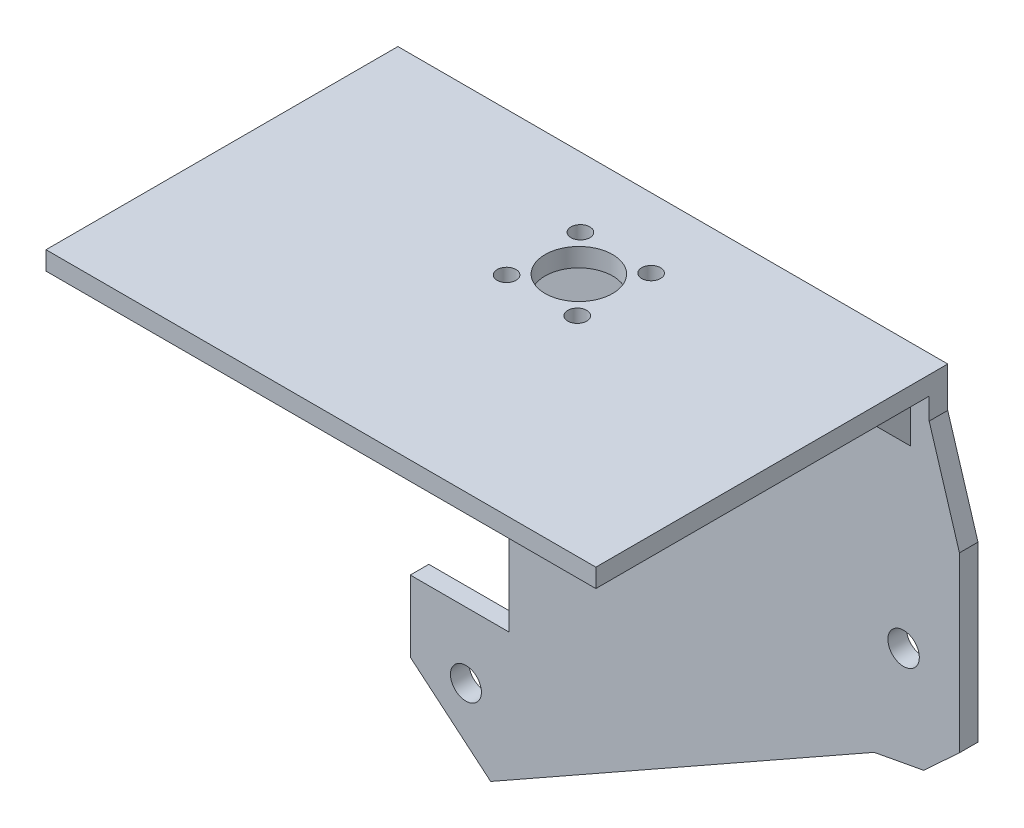
ISO-10303-21;
HEADER;
FILE_DESCRIPTION(('STEP AP214'),'2;1');
FILE_NAME('part.step','',(''),(''),'','','');
FILE_SCHEMA(('AUTOMOTIVE_DESIGN { 1 0 10303 214 1 1 1 1 }'));
ENDSEC;
DATA;
#1=APPLICATION_CONTEXT('core data for automotive mechanical design processes');
#2=APPLICATION_PROTOCOL_DEFINITION('international standard','automotive_design',2000,#1);
#3=PRODUCT_CONTEXT('',#1,'mechanical');
#4=PRODUCT('Part','Part','',(#3));
#5=PRODUCT_RELATED_PRODUCT_CATEGORY('part','',(#4));
#6=PRODUCT_DEFINITION_FORMATION('','',#4);
#7=PRODUCT_DEFINITION_CONTEXT('part definition',#1,'design');
#8=PRODUCT_DEFINITION('design','',#6,#7);
#9=PRODUCT_DEFINITION_SHAPE('','',#8);
#10=(LENGTH_UNIT() NAMED_UNIT(*) SI_UNIT(.MILLI.,.METRE.));
#11=(NAMED_UNIT(*) PLANE_ANGLE_UNIT() SI_UNIT($,.RADIAN.));
#12=(NAMED_UNIT(*) SI_UNIT($,.STERADIAN.) SOLID_ANGLE_UNIT());
#13=UNCERTAINTY_MEASURE_WITH_UNIT(LENGTH_MEASURE(1.E-05),#10,'distance_accuracy_value','');
#14=(GEOMETRIC_REPRESENTATION_CONTEXT(3) GLOBAL_UNCERTAINTY_ASSIGNED_CONTEXT((#13)) GLOBAL_UNIT_ASSIGNED_CONTEXT((#10,
#11,#12)) REPRESENTATION_CONTEXT('',''));
#15=CARTESIAN_POINT('',(0.,0.,0.));
#16=DIRECTION('',(0.,0.,1.));
#17=DIRECTION('',(1.,0.,0.));
#18=AXIS2_PLACEMENT_3D('',#15,#16,#17);
#19=CARTESIAN_POINT('',(1.39999999999998,-11.5,0.));
#20=DIRECTION('',(0.,-0.707106781186548,0.707106781186547));
#21=DIRECTION('',(0.,-0.707106781186547,-0.707106781186548));
#22=AXIS2_PLACEMENT_3D('',#19,#20,#21);
#23=PLANE('',#22);
#24=DIRECTION('',(1.,0.,0.));
#25=VECTOR('',#24,1.);
#26=CARTESIAN_POINT('',(0.,-8.5,3.));
#27=LINE('',#26,#25);
#28=CARTESIAN_POINT('',(1.39999999999998,-8.5,3.));
#29=VERTEX_POINT('',#28);
#30=CARTESIAN_POINT('',(4.572,-8.5,3.));
#31=VERTEX_POINT('',#30);
#32=EDGE_CURVE('E48',#29,#31,#27,.T.);
#33=ORIENTED_EDGE('',*,*,#32,.T.);
#34=DIRECTION('',(0.,0.707106781186547,0.707106781186548));
#35=VECTOR('',#34,1.);
#36=CARTESIAN_POINT('',(4.572,-11.5,0.));
#37=LINE('',#36,#35);
#38=CARTESIAN_POINT('',(4.572,0.,11.5));
#39=VERTEX_POINT('',#38);
#40=EDGE_CURVE('E11',#31,#39,#37,.T.);
#41=ORIENTED_EDGE('',*,*,#40,.T.);
#42=DIRECTION('',(1.,0.,0.));
#43=VECTOR('',#42,1.);
#44=CARTESIAN_POINT('',(1.39999999999998,0.,11.5));
#45=LINE('',#44,#43);
#46=CARTESIAN_POINT('',(1.39999999999998,0.,11.5));
#47=VERTEX_POINT('',#46);
#48=EDGE_CURVE('E199',#47,#39,#45,.T.);
#49=ORIENTED_EDGE('',*,*,#48,.F.);
#50=DIRECTION('',(0.,-0.707106781186547,-0.707106781186548));
#51=VECTOR('',#50,1.);
#52=CARTESIAN_POINT('',(1.39999999999998,-11.5,0.));
#53=LINE('',#52,#51);
#54=EDGE_CURVE('E194',#47,#29,#53,.T.);
#55=ORIENTED_EDGE('',*,*,#54,.T.);
#56=EDGE_LOOP('',(#33,#41,#49,#55));
#57=FACE_BOUND('',#56,.T.);
#58=ADVANCED_FACE('F33',(#57),#23,.T.);
#59=CARTESIAN_POINT('',(79.502,0.,11.5));
#60=VERTEX_POINT('',#59);
#61=CARTESIAN_POINT('',(85.9,0.,11.5));
#62=VERTEX_POINT('',#61);
#63=EDGE_CURVE('E355',#60,#62,#45,.T.);
#64=ORIENTED_EDGE('',*,*,#63,.F.);
#65=DIRECTION('',(0.,-0.707106781186547,-0.707106781186548));
#66=VECTOR('',#65,1.);
#67=CARTESIAN_POINT('',(79.502,-11.5,0.));
#68=LINE('',#67,#66);
#69=CARTESIAN_POINT('',(79.502,-8.5,3.));
#70=VERTEX_POINT('',#69);
#71=EDGE_CURVE('E41',#60,#70,#68,.T.);
#72=ORIENTED_EDGE('',*,*,#71,.T.);
#73=CARTESIAN_POINT('',(85.9,-8.5,3.));
#74=VERTEX_POINT('',#73);
#75=EDGE_CURVE('E56',#70,#74,#27,.T.);
#76=ORIENTED_EDGE('',*,*,#75,.T.);
#77=DIRECTION('',(0.,-0.707106781186547,-0.707106781186548));
#78=VECTOR('',#77,1.);
#79=CARTESIAN_POINT('',(85.9,-11.5,0.));
#80=LINE('',#79,#78);
#81=EDGE_CURVE('E352',#62,#74,#80,.T.);
#82=ORIENTED_EDGE('',*,*,#81,.F.);
#83=EDGE_LOOP('',(#64,#72,#76,#82));
#84=FACE_BOUND('',#83,.T.);
#85=ADVANCED_FACE('F354',(#84),#23,.T.);
#86=CARTESIAN_POINT('',(0.,0.,3.));
#87=DIRECTION('',(1.,0.,0.));
#88=DIRECTION('',(0.,1.,0.));
#89=AXIS2_PLACEMENT_3D('',#86,#87,#88);
#90=PLANE('',#89);
#91=DIRECTION('',(0.,-1.,0.));
#92=VECTOR('',#91,1.);
#93=CARTESIAN_POINT('',(0.,0.,0.));
#94=LINE('',#93,#92);
#95=CARTESIAN_POINT('',(0.,3.,0.));
#96=VERTEX_POINT('',#95);
#97=CARTESIAN_POINT('',(0.,-16.2,0.));
#98=VERTEX_POINT('',#97);
#99=EDGE_CURVE('E258',#96,#98,#94,.T.);
#100=ORIENTED_EDGE('',*,*,#99,.T.);
#101=DIRECTION('',(0.,0.,-1.));
#102=VECTOR('',#101,1.);
#103=CARTESIAN_POINT('',(0.,-16.2,3.));
#104=LINE('',#103,#102);
#105=CARTESIAN_POINT('',(0.,-16.2,3.));
#106=VERTEX_POINT('',#105);
#107=EDGE_CURVE('E343',#106,#98,#104,.T.);
#108=ORIENTED_EDGE('',*,*,#107,.F.);
#109=DIRECTION('',(0.,-1.,0.));
#110=VECTOR('',#109,1.);
#111=CARTESIAN_POINT('',(0.,0.,3.));
#112=LINE('',#111,#110);
#113=CARTESIAN_POINT('',(0.,0.,3.));
#114=VERTEX_POINT('',#113);
#115=EDGE_CURVE('E259',#114,#106,#112,.T.);
#116=ORIENTED_EDGE('',*,*,#115,.F.);
#117=DIRECTION('',(0.,0.,1.));
#118=VECTOR('',#117,1.);
#119=CARTESIAN_POINT('',(0.,0.,0.));
#120=LINE('',#119,#118);
#121=CARTESIAN_POINT('',(0.,0.,56.896));
#122=VERTEX_POINT('',#121);
#123=EDGE_CURVE('E232',#114,#122,#120,.T.);
#124=ORIENTED_EDGE('',*,*,#123,.T.);
#125=DIRECTION('',(0.,-1.,0.));
#126=VECTOR('',#125,1.);
#127=CARTESIAN_POINT('',(0.,3.,56.896));
#128=LINE('',#127,#126);
#129=CARTESIAN_POINT('',(0.,3.,56.896));
#130=VERTEX_POINT('',#129);
#131=EDGE_CURVE('E255',#130,#122,#128,.T.);
#132=ORIENTED_EDGE('',*,*,#131,.F.);
#133=DIRECTION('',(0.,0.,1.));
#134=VECTOR('',#133,1.);
#135=CARTESIAN_POINT('',(0.,3.,0.));
#136=LINE('',#135,#134);
#137=EDGE_CURVE('E235',#96,#130,#136,.T.);
#138=ORIENTED_EDGE('',*,*,#137,.F.);
#139=EDGE_LOOP('',(#100,#108,#116,#124,#132,#138));
#140=FACE_BOUND('',#139,.T.);
#141=ADVANCED_FACE('F35',(#140),#90,.F.);
#142=CARTESIAN_POINT('',(0.,-16.2,3.));
#143=DIRECTION('',(0.,1.,0.));
#144=DIRECTION('',(0.,0.,1.));
#145=AXIS2_PLACEMENT_3D('',#142,#143,#144);
#146=PLANE('',#145);
#147=DIRECTION('',(1.,0.,0.));
#148=VECTOR('',#147,1.);
#149=CARTESIAN_POINT('',(0.,-16.2,0.));
#150=LINE('',#149,#148);
#151=CARTESIAN_POINT('',(21.,-16.2,0.));
#152=VERTEX_POINT('',#151);
#153=EDGE_CURVE('E293',#98,#152,#150,.T.);
#154=ORIENTED_EDGE('',*,*,#153,.T.);
#155=DIRECTION('',(0.,0.,-1.));
#156=VECTOR('',#155,1.);
#157=CARTESIAN_POINT('',(21.,-16.2,3.));
#158=LINE('',#157,#156);
#159=CARTESIAN_POINT('',(21.,-16.2,3.));
#160=VERTEX_POINT('',#159);
#161=EDGE_CURVE('E340',#160,#152,#158,.T.);
#162=ORIENTED_EDGE('',*,*,#161,.F.);
#163=DIRECTION('',(1.,0.,0.));
#164=VECTOR('',#163,1.);
#165=CARTESIAN_POINT('',(0.,-16.2,3.));
#166=LINE('',#165,#164);
#167=EDGE_CURVE('E262',#106,#160,#166,.T.);
#168=ORIENTED_EDGE('',*,*,#167,.F.);
#169=ORIENTED_EDGE('',*,*,#107,.T.);
#170=EDGE_LOOP('',(#154,#162,#168,#169));
#171=FACE_BOUND('',#170,.T.);
#172=ADVANCED_FACE('F481',(#171),#146,.F.);
#173=CARTESIAN_POINT('',(21.,-16.2,3.));
#174=DIRECTION('',(1.,0.,0.));
#175=DIRECTION('',(0.,1.,0.));
#176=AXIS2_PLACEMENT_3D('',#173,#174,#175);
#177=PLANE('',#176);
#178=DIRECTION('',(0.,-1.,0.));
#179=VECTOR('',#178,1.);
#180=CARTESIAN_POINT('',(21.,-16.2,0.));
#181=LINE('',#180,#179);
#182=CARTESIAN_POINT('',(21.,-67.,0.));
#183=VERTEX_POINT('',#182);
#184=EDGE_CURVE('E295',#152,#183,#181,.T.);
#185=ORIENTED_EDGE('',*,*,#184,.T.);
#186=DIRECTION('',(0.,0.,-1.));
#187=VECTOR('',#186,1.);
#188=CARTESIAN_POINT('',(21.,-67.,3.));
#189=LINE('',#188,#187);
#190=CARTESIAN_POINT('',(21.,-67.,3.));
#191=VERTEX_POINT('',#190);
#192=EDGE_CURVE('E337',#191,#183,#189,.T.);
#193=ORIENTED_EDGE('',*,*,#192,.F.);
#194=DIRECTION('',(0.,-1.,0.));
#195=VECTOR('',#194,1.);
#196=CARTESIAN_POINT('',(21.,-16.2,3.));
#197=LINE('',#196,#195);
#198=EDGE_CURVE('E265',#160,#191,#197,.T.);
#199=ORIENTED_EDGE('',*,*,#198,.F.);
#200=ORIENTED_EDGE('',*,*,#161,.T.);
#201=EDGE_LOOP('',(#185,#193,#199,#200));
#202=FACE_BOUND('',#201,.T.);
#203=ADVANCED_FACE('F478',(#202),#177,.F.);
#204=CARTESIAN_POINT('',(21.,-67.,3.));
#205=DIRECTION('',(0.,-1.,0.));
#206=DIRECTION('',(0.,0.,-1.));
#207=AXIS2_PLACEMENT_3D('',#204,#205,#206);
#208=PLANE('',#207);
#209=DIRECTION('',(-1.,0.,0.));
#210=VECTOR('',#209,1.);
#211=CARTESIAN_POINT('',(21.,-67.,0.));
#212=LINE('',#211,#210);
#213=CARTESIAN_POINT('',(5.00000000000001,-67.,0.));
#214=VERTEX_POINT('',#213);
#215=EDGE_CURVE('E297',#183,#214,#212,.T.);
#216=ORIENTED_EDGE('',*,*,#215,.T.);
#217=DIRECTION('',(0.,0.,-1.));
#218=VECTOR('',#217,1.);
#219=CARTESIAN_POINT('',(5.00000000000001,-67.,3.));
#220=LINE('',#219,#218);
#221=CARTESIAN_POINT('',(5.00000000000001,-67.,3.));
#222=VERTEX_POINT('',#221);
#223=EDGE_CURVE('E334',#222,#214,#220,.T.);
#224=ORIENTED_EDGE('',*,*,#223,.F.);
#225=DIRECTION('',(-1.,0.,0.));
#226=VECTOR('',#225,1.);
#227=CARTESIAN_POINT('',(21.,-67.,3.));
#228=LINE('',#227,#226);
#229=EDGE_CURVE('E267',#191,#222,#228,.T.);
#230=ORIENTED_EDGE('',*,*,#229,.F.);
#231=ORIENTED_EDGE('',*,*,#192,.T.);
#232=EDGE_LOOP('',(#216,#224,#230,#231));
#233=FACE_BOUND('',#232,.T.);
#234=ADVANCED_FACE('F474',(#233),#208,.F.);
#235=CARTESIAN_POINT('',(5.00000000000001,-67.,3.));
#236=DIRECTION('',(1.,0.,0.));
#237=DIRECTION('',(0.,1.,0.));
#238=AXIS2_PLACEMENT_3D('',#235,#236,#237);
#239=PLANE('',#238);
#240=DIRECTION('',(0.,-1.,0.));
#241=VECTOR('',#240,1.);
#242=CARTESIAN_POINT('',(5.00000000000001,-67.,0.));
#243=LINE('',#242,#241);
#244=CARTESIAN_POINT('',(5.00000000000001,-78.5,0.));
#245=VERTEX_POINT('',#244);
#246=EDGE_CURVE('E299',#214,#245,#243,.T.);
#247=ORIENTED_EDGE('',*,*,#246,.T.);
#248=DIRECTION('',(0.,0.,-1.));
#249=VECTOR('',#248,1.);
#250=CARTESIAN_POINT('',(5.00000000000001,-78.5,3.));
#251=LINE('',#250,#249);
#252=CARTESIAN_POINT('',(5.00000000000001,-78.5,3.));
#253=VERTEX_POINT('',#252);
#254=EDGE_CURVE('E331',#253,#245,#251,.T.);
#255=ORIENTED_EDGE('',*,*,#254,.F.);
#256=DIRECTION('',(0.,-1.,0.));
#257=VECTOR('',#256,1.);
#258=CARTESIAN_POINT('',(5.00000000000001,-67.,3.));
#259=LINE('',#258,#257);
#260=EDGE_CURVE('E269',#222,#253,#259,.T.);
#261=ORIENTED_EDGE('',*,*,#260,.F.);
#262=ORIENTED_EDGE('',*,*,#223,.T.);
#263=EDGE_LOOP('',(#247,#255,#261,#262));
#264=FACE_BOUND('',#263,.T.);
#265=ADVANCED_FACE('F470',(#264),#239,.F.);
#266=CARTESIAN_POINT('',(5.00000000000001,-78.5,3.));
#267=DIRECTION('',(0.642787609686537,0.76604444311898,0.));
#268=DIRECTION('',(-0.76604444311898,0.642787609686537,0.));
#269=AXIS2_PLACEMENT_3D('',#266,#267,#268);
#270=PLANE('',#269);
#271=DIRECTION('',(0.76604444311898,-0.642787609686537,0.));
#272=VECTOR('',#271,1.);
#273=CARTESIAN_POINT('',(5.00000000000001,-78.5,0.));
#274=LINE('',#273,#272);
#275=CARTESIAN_POINT('',(18.,-89.4082952053046,0.));
#276=VERTEX_POINT('',#275);
#277=EDGE_CURVE('E301',#245,#276,#274,.T.);
#278=ORIENTED_EDGE('',*,*,#277,.T.);
#279=DIRECTION('',(0.,0.,-1.));
#280=VECTOR('',#279,1.);
#281=CARTESIAN_POINT('',(18.,-89.4082952053046,3.));
#282=LINE('',#281,#280);
#283=CARTESIAN_POINT('',(18.,-89.4082952053046,3.));
#284=VERTEX_POINT('',#283);
#285=EDGE_CURVE('E328',#284,#276,#282,.T.);
#286=ORIENTED_EDGE('',*,*,#285,.F.);
#287=DIRECTION('',(0.76604444311898,-0.642787609686537,0.));
#288=VECTOR('',#287,1.);
#289=CARTESIAN_POINT('',(5.00000000000001,-78.5,3.));
#290=LINE('',#289,#288);
#291=EDGE_CURVE('E271',#253,#284,#290,.T.);
#292=ORIENTED_EDGE('',*,*,#291,.F.);
#293=ORIENTED_EDGE('',*,*,#254,.T.);
#294=EDGE_LOOP('',(#278,#286,#292,#293));
#295=FACE_BOUND('',#294,.T.);
#296=ADVANCED_FACE('F466',(#295),#270,.F.);
#297=CARTESIAN_POINT('',(18.,-89.4082952053046,3.));
#298=DIRECTION('',(-0.492423560103472,0.870355695939897,0.));
#299=DIRECTION('',(-0.870355695939897,-0.492423560103472,0.));
#300=AXIS2_PLACEMENT_3D('',#297,#298,#299);
#301=PLANE('',#300);
#302=DIRECTION('',(0.870355695939897,0.492423560103472,0.));
#303=VECTOR('',#302,1.);
#304=CARTESIAN_POINT('',(18.,-89.4082952053046,0.));
#305=LINE('',#304,#303);
#306=CARTESIAN_POINT('',(80.,-54.3303829576624,0.));
#307=VERTEX_POINT('',#306);
#308=EDGE_CURVE('E303',#276,#307,#305,.T.);
#309=ORIENTED_EDGE('',*,*,#308,.T.);
#310=DIRECTION('',(0.,0.,-1.));
#311=VECTOR('',#310,1.);
#312=CARTESIAN_POINT('',(80.,-54.3303829576624,3.));
#313=LINE('',#312,#311);
#314=CARTESIAN_POINT('',(80.,-54.3303829576624,3.));
#315=VERTEX_POINT('',#314);
#316=EDGE_CURVE('E325',#315,#307,#313,.T.);
#317=ORIENTED_EDGE('',*,*,#316,.F.);
#318=DIRECTION('',(0.870355695939897,0.492423560103472,0.));
#319=VECTOR('',#318,1.);
#320=CARTESIAN_POINT('',(18.,-89.4082952053046,3.));
#321=LINE('',#320,#319);
#322=EDGE_CURVE('E273',#284,#315,#321,.T.);
#323=ORIENTED_EDGE('',*,*,#322,.F.);
#324=ORIENTED_EDGE('',*,*,#285,.T.);
#325=EDGE_LOOP('',(#309,#317,#323,#324));
#326=FACE_BOUND('',#325,.T.);
#327=ADVANCED_FACE('F462',(#326),#301,.F.);
#328=CARTESIAN_POINT('',(80.,-54.3303829576624,3.));
#329=DIRECTION('',(-0.182235525492152,0.983254907563954,0.));
#330=DIRECTION('',(-0.983254907563954,-0.182235525492152,0.));
#331=AXIS2_PLACEMENT_3D('',#328,#329,#330);
#332=PLANE('',#331);
#333=DIRECTION('',(0.983254907563954,0.182235525492152,0.));
#334=VECTOR('',#333,1.);
#335=CARTESIAN_POINT('',(80.,-54.3303829576624,0.));
#336=LINE('',#335,#334);
#337=CARTESIAN_POINT('',(88.,-52.84767059821,0.));
#338=VERTEX_POINT('',#337);
#339=EDGE_CURVE('E305',#307,#338,#336,.T.);
#340=ORIENTED_EDGE('',*,*,#339,.T.);
#341=DIRECTION('',(0.,0.,-1.));
#342=VECTOR('',#341,1.);
#343=CARTESIAN_POINT('',(88.,-52.84767059821,3.));
#344=LINE('',#343,#342);
#345=CARTESIAN_POINT('',(88.,-52.84767059821,3.));
#346=VERTEX_POINT('',#345);
#347=EDGE_CURVE('E322',#346,#338,#344,.T.);
#348=ORIENTED_EDGE('',*,*,#347,.F.);
#349=DIRECTION('',(0.983254907563954,0.182235525492152,0.));
#350=VECTOR('',#349,1.);
#351=CARTESIAN_POINT('',(80.,-54.3303829576624,3.));
#352=LINE('',#351,#350);
#353=EDGE_CURVE('E275',#315,#346,#352,.T.);
#354=ORIENTED_EDGE('',*,*,#353,.F.);
#355=ORIENTED_EDGE('',*,*,#316,.T.);
#356=EDGE_LOOP('',(#340,#348,#354,#355));
#357=FACE_BOUND('',#356,.T.);
#358=ADVANCED_FACE('F458',(#357),#332,.F.);
#359=CARTESIAN_POINT('',(88.,-52.84767059821,3.));
#360=DIRECTION('',(-0.678382452150343,0.734708955038992,0.));
#361=DIRECTION('',(-0.734708955038992,-0.678382452150343,0.));
#362=AXIS2_PLACEMENT_3D('',#359,#360,#361);
#363=PLANE('',#362);
#364=DIRECTION('',(0.734708955038992,0.678382452150343,0.));
#365=VECTOR('',#364,1.);
#366=CARTESIAN_POINT('',(88.,-52.84767059821,0.));
#367=LINE('',#366,#365);
#368=CARTESIAN_POINT('',(93.7916909033386,-47.5,0.));
#369=VERTEX_POINT('',#368);
#370=EDGE_CURVE('E307',#338,#369,#367,.T.);
#371=ORIENTED_EDGE('',*,*,#370,.T.);
#372=DIRECTION('',(0.,0.,-1.));
#373=VECTOR('',#372,1.);
#374=CARTESIAN_POINT('',(93.7916909033386,-47.5,3.));
#375=LINE('',#374,#373);
#376=CARTESIAN_POINT('',(93.7916909033386,-47.5,3.));
#377=VERTEX_POINT('',#376);
#378=EDGE_CURVE('E319',#377,#369,#375,.T.);
#379=ORIENTED_EDGE('',*,*,#378,.F.);
#380=DIRECTION('',(0.734708955038992,0.678382452150343,0.));
#381=VECTOR('',#380,1.);
#382=CARTESIAN_POINT('',(88.,-52.84767059821,3.));
#383=LINE('',#382,#381);
#384=EDGE_CURVE('E277',#346,#377,#383,.T.);
#385=ORIENTED_EDGE('',*,*,#384,.F.);
#386=ORIENTED_EDGE('',*,*,#347,.T.);
#387=EDGE_LOOP('',(#371,#379,#385,#386));
#388=FACE_BOUND('',#387,.T.);
#389=ADVANCED_FACE('F454',(#388),#363,.F.);
#390=CARTESIAN_POINT('',(93.7916909033386,-19.5,3.));
#391=DIRECTION('',(-1.,0.,0.));
#392=DIRECTION('',(0.,-1.,0.));
#393=AXIS2_PLACEMENT_3D('',#390,#391,#392);
#394=PLANE('',#393);
#395=DIRECTION('',(0.,1.,0.));
#396=VECTOR('',#395,1.);
#397=CARTESIAN_POINT('',(93.7916909033386,-19.5,0.));
#398=LINE('',#397,#396);
#399=CARTESIAN_POINT('',(93.7916909033386,-19.5,0.));
#400=VERTEX_POINT('',#399);
#401=EDGE_CURVE('E309',#369,#400,#398,.T.);
#402=ORIENTED_EDGE('',*,*,#401,.T.);
#403=DIRECTION('',(0.,0.,-1.));
#404=VECTOR('',#403,1.);
#405=CARTESIAN_POINT('',(93.7916909033386,-19.5,3.));
#406=LINE('',#405,#404);
#407=CARTESIAN_POINT('',(93.7916909033386,-19.5,3.));
#408=VERTEX_POINT('',#407);
#409=EDGE_CURVE('E316',#408,#400,#406,.T.);
#410=ORIENTED_EDGE('',*,*,#409,.F.);
#411=DIRECTION('',(0.,1.,0.));
#412=VECTOR('',#411,1.);
#413=CARTESIAN_POINT('',(93.7916909033386,-19.5,3.));
#414=LINE('',#413,#412);
#415=EDGE_CURVE('E279',#377,#408,#414,.T.);
#416=ORIENTED_EDGE('',*,*,#415,.F.);
#417=ORIENTED_EDGE('',*,*,#378,.T.);
#418=EDGE_LOOP('',(#402,#410,#416,#417));
#419=FACE_BOUND('',#418,.T.);
#420=ADVANCED_FACE('F450',(#419),#394,.F.);
#421=CARTESIAN_POINT('',(88.9,-3.5,3.));
#422=DIRECTION('',(-0.956304755963035,-0.292371704722738,0.));
#423=DIRECTION('',(0.292371704722738,-0.956304755963035,0.));
#424=AXIS2_PLACEMENT_3D('',#421,#422,#423);
#425=PLANE('',#424);
#426=DIRECTION('',(-0.292371704722738,0.956304755963035,0.));
#427=VECTOR('',#426,1.);
#428=CARTESIAN_POINT('',(88.9,-3.5,0.));
#429=LINE('',#428,#427);
#430=CARTESIAN_POINT('',(88.9,-3.5,0.));
#431=VERTEX_POINT('',#430);
#432=EDGE_CURVE('E311',#400,#431,#429,.T.);
#433=ORIENTED_EDGE('',*,*,#432,.T.);
#434=DIRECTION('',(0.,0.,-1.));
#435=VECTOR('',#434,1.);
#436=CARTESIAN_POINT('',(88.9,-3.5,3.));
#437=LINE('',#436,#435);
#438=CARTESIAN_POINT('',(88.9,-3.5,3.));
#439=VERTEX_POINT('',#438);
#440=EDGE_CURVE('E290',#439,#431,#437,.T.);
#441=ORIENTED_EDGE('',*,*,#440,.F.);
#442=DIRECTION('',(-0.292371704722738,0.956304755963035,0.));
#443=VECTOR('',#442,1.);
#444=CARTESIAN_POINT('',(88.9,-3.5,3.));
#445=LINE('',#444,#443);
#446=EDGE_CURVE('E281',#408,#439,#445,.T.);
#447=ORIENTED_EDGE('',*,*,#446,.F.);
#448=ORIENTED_EDGE('',*,*,#409,.T.);
#449=EDGE_LOOP('',(#433,#441,#447,#448));
#450=FACE_BOUND('',#449,.T.);
#451=ADVANCED_FACE('F446',(#450),#425,.F.);
#452=CARTESIAN_POINT('',(88.9,0.,3.));
#453=DIRECTION('',(-1.,0.,0.));
#454=DIRECTION('',(0.,0.,1.));
#455=AXIS2_PLACEMENT_3D('',#452,#453,#454);
#456=PLANE('',#455);
#457=DIRECTION('',(0.,1.,0.));
#458=VECTOR('',#457,1.);
#459=CARTESIAN_POINT('',(88.9,0.,0.));
#460=LINE('',#459,#458);
#461=CARTESIAN_POINT('',(88.9,3.,0.));
#462=VERTEX_POINT('',#461);
#463=EDGE_CURVE('E263',#431,#462,#460,.T.);
#464=ORIENTED_EDGE('',*,*,#463,.T.);
#465=DIRECTION('',(0.,0.,-1.));
#466=VECTOR('',#465,1.);
#467=CARTESIAN_POINT('',(88.9,3.,0.));
#468=LINE('',#467,#466);
#469=CARTESIAN_POINT('',(88.9,3.,56.896));
#470=VERTEX_POINT('',#469);
#471=EDGE_CURVE('E241',#470,#462,#468,.T.);
#472=ORIENTED_EDGE('',*,*,#471,.F.);
#473=DIRECTION('',(0.,-1.,0.));
#474=VECTOR('',#473,1.);
#475=CARTESIAN_POINT('',(88.9,3.,56.896));
#476=LINE('',#475,#474);
#477=CARTESIAN_POINT('',(88.9,0.,56.896));
#478=VERTEX_POINT('',#477);
#479=EDGE_CURVE('E247',#470,#478,#476,.T.);
#480=ORIENTED_EDGE('',*,*,#479,.T.);
#481=DIRECTION('',(0.,0.,-1.));
#482=VECTOR('',#481,1.);
#483=CARTESIAN_POINT('',(88.9,0.,0.));
#484=LINE('',#483,#482);
#485=CARTESIAN_POINT('',(88.9,0.,3.));
#486=VERTEX_POINT('',#485);
#487=EDGE_CURVE('E239',#478,#486,#484,.T.);
#488=ORIENTED_EDGE('',*,*,#487,.T.);
#489=DIRECTION('',(0.,1.,0.));
#490=VECTOR('',#489,1.);
#491=CARTESIAN_POINT('',(88.9,0.,3.));
#492=LINE('',#491,#490);
#493=EDGE_CURVE('E283',#439,#486,#492,.T.);
#494=ORIENTED_EDGE('',*,*,#493,.F.);
#495=ORIENTED_EDGE('',*,*,#440,.T.);
#496=EDGE_LOOP('',(#464,#472,#480,#488,#494,#495));
#497=FACE_BOUND('',#496,.T.);
#498=ADVANCED_FACE('F440',(#497),#456,.F.);
#499=CARTESIAN_POINT('',(0.,0.,3.));
#500=DIRECTION('',(0.,0.,1.));
#501=DIRECTION('',(1.,0.,0.));
#502=AXIS2_PLACEMENT_3D('',#499,#500,#501);
#503=PLANE('',#502);
#504=ORIENTED_EDGE('',*,*,#75,.F.);
#505=DIRECTION('',(0.,1.,0.));
#506=VECTOR('',#505,1.);
#507=CARTESIAN_POINT('',(79.502,0.,3.));
#508=LINE('',#507,#506);
#509=CARTESIAN_POINT('',(79.502,0.,3.));
#510=VERTEX_POINT('',#509);
#511=EDGE_CURVE('E190',#70,#510,#508,.T.);
#512=ORIENTED_EDGE('',*,*,#511,.T.);
#513=DIRECTION('',(-1.,0.,0.));
#514=VECTOR('',#513,1.);
#515=CARTESIAN_POINT('',(4.572,0.,3.));
#516=LINE('',#515,#514);
#517=CARTESIAN_POINT('',(4.572,0.,3.));
#518=VERTEX_POINT('',#517);
#519=EDGE_CURVE('E189',#510,#518,#516,.T.);
#520=ORIENTED_EDGE('',*,*,#519,.T.);
#521=DIRECTION('',(0.,-1.,0.));
#522=VECTOR('',#521,1.);
#523=CARTESIAN_POINT('',(4.572,0.,3.));
#524=LINE('',#523,#522);
#525=EDGE_CURVE('E179',#518,#31,#524,.T.);
#526=ORIENTED_EDGE('',*,*,#525,.T.);
#527=ORIENTED_EDGE('',*,*,#32,.F.);
#528=DIRECTION('',(0.,-1.,0.));
#529=VECTOR('',#528,1.);
#530=CARTESIAN_POINT('',(1.39999999999998,0.,3.));
#531=LINE('',#530,#529);
#532=CARTESIAN_POINT('',(1.39999999999998,0.,3.));
#533=VERTEX_POINT('',#532);
#534=EDGE_CURVE('E197',#533,#29,#531,.T.);
#535=ORIENTED_EDGE('',*,*,#534,.F.);
#536=DIRECTION('',(-1.,0.,0.));
#537=VECTOR('',#536,1.);
#538=CARTESIAN_POINT('',(0.,0.,3.));
#539=LINE('',#538,#537);
#540=EDGE_CURVE('E286',#533,#114,#539,.T.);
#541=ORIENTED_EDGE('',*,*,#540,.T.);
#542=ORIENTED_EDGE('',*,*,#115,.T.);
#543=ORIENTED_EDGE('',*,*,#167,.T.);
#544=ORIENTED_EDGE('',*,*,#198,.T.);
#545=ORIENTED_EDGE('',*,*,#229,.T.);
#546=ORIENTED_EDGE('',*,*,#260,.T.);
#547=ORIENTED_EDGE('',*,*,#291,.T.);
#548=ORIENTED_EDGE('',*,*,#322,.T.);
#549=ORIENTED_EDGE('',*,*,#353,.T.);
#550=ORIENTED_EDGE('',*,*,#384,.T.);
#551=ORIENTED_EDGE('',*,*,#415,.T.);
#552=ORIENTED_EDGE('',*,*,#446,.T.);
#553=ORIENTED_EDGE('',*,*,#493,.T.);
#554=CARTESIAN_POINT('',(85.9,0.,3.));
#555=VERTEX_POINT('',#554);
#556=EDGE_CURVE('E287',#486,#555,#539,.T.);
#557=ORIENTED_EDGE('',*,*,#556,.T.);
#558=DIRECTION('',(0.,-1.,0.));
#559=VECTOR('',#558,1.);
#560=CARTESIAN_POINT('',(85.9,0.,3.));
#561=LINE('',#560,#559);
#562=EDGE_CURVE('E195',#555,#74,#561,.T.);
#563=ORIENTED_EDGE('',*,*,#562,.T.);
#564=EDGE_LOOP('',(#504,#512,#520,#526,#527,#535,#541,#542,#543,#544,#545,#546,#547,#548,#549,
#550,#551,#552,#553,#557,#563));
#565=FACE_BOUND('',#564,.T.);
#566=CARTESIAN_POINT('',(14.,-77.66,3.));
#567=DIRECTION('',(0.,0.,1.));
#568=DIRECTION('',(1.,0.,0.));
#569=AXIS2_PLACEMENT_3D('',#566,#567,#568);
#570=CIRCLE('',#569,2.5);
#571=CARTESIAN_POINT('',(16.5,-77.66,3.));
#572=VERTEX_POINT('',#571);
#573=EDGE_CURVE('E371',#572,#572,#570,.T.);
#574=ORIENTED_EDGE('',*,*,#573,.F.);
#575=EDGE_LOOP('',(#574));
#576=FACE_BOUND('',#575,.T.);
#577=CARTESIAN_POINT('',(84.763,-37.386,3.));
#578=DIRECTION('',(0.,0.,1.));
#579=DIRECTION('',(1.,0.,0.));
#580=AXIS2_PLACEMENT_3D('',#577,#578,#579);
#581=CIRCLE('',#580,2.54);
#582=CARTESIAN_POINT('',(87.303,-37.386,3.));
#583=VERTEX_POINT('',#582);
#584=EDGE_CURVE('E375',#583,#583,#581,.T.);
#585=ORIENTED_EDGE('',*,*,#584,.F.);
#586=EDGE_LOOP('',(#585));
#587=FACE_BOUND('',#586,.T.);
#588=CARTESIAN_POINT('',(14.,-7.16,3.));
#589=DIRECTION('',(0.,0.,1.));
#590=DIRECTION('',(1.,0.,0.));
#591=AXIS2_PLACEMENT_3D('',#588,#589,#590);
#592=CIRCLE('',#591,2.5);
#593=CARTESIAN_POINT('',(16.5,-7.16,3.));
#594=VERTEX_POINT('',#593);
#595=EDGE_CURVE('E372',#594,#594,#592,.T.);
#596=ORIENTED_EDGE('',*,*,#595,.F.);
#597=EDGE_LOOP('',(#596));
#598=FACE_BOUND('',#597,.T.);
#599=ADVANCED_FACE('F185',(#565,#576,#587,#598),#503,.T.);
#600=CARTESIAN_POINT('',(0.,0.,0.));
#601=DIRECTION('',(0.,0.,1.));
#602=DIRECTION('',(1.,0.,0.));
#603=AXIS2_PLACEMENT_3D('',#600,#601,#602);
#604=PLANE('',#603);
#605=CARTESIAN_POINT('',(14.,-77.66,0.));
#606=DIRECTION('',(0.,0.,1.));
#607=DIRECTION('',(1.,0.,0.));
#608=AXIS2_PLACEMENT_3D('',#605,#606,#607);
#609=CIRCLE('',#608,2.5);
#610=CARTESIAN_POINT('',(16.5,-77.66,0.));
#611=VERTEX_POINT('',#610);
#612=EDGE_CURVE('E349',#611,#611,#609,.T.);
#613=ORIENTED_EDGE('',*,*,#612,.T.);
#614=EDGE_LOOP('',(#613));
#615=FACE_BOUND('',#614,.T.);
#616=CARTESIAN_POINT('',(84.763,-37.386,0.));
#617=DIRECTION('',(0.,0.,1.));
#618=DIRECTION('',(1.,0.,0.));
#619=AXIS2_PLACEMENT_3D('',#616,#617,#618);
#620=CIRCLE('',#619,2.54);
#621=CARTESIAN_POINT('',(87.303,-37.386,0.));
#622=VERTEX_POINT('',#621);
#623=EDGE_CURVE('E346',#622,#622,#620,.T.);
#624=ORIENTED_EDGE('',*,*,#623,.T.);
#625=EDGE_LOOP('',(#624));
#626=FACE_BOUND('',#625,.T.);
#627=CARTESIAN_POINT('',(14.,-7.16,0.));
#628=DIRECTION('',(0.,0.,1.));
#629=DIRECTION('',(1.,0.,0.));
#630=AXIS2_PLACEMENT_3D('',#627,#628,#629);
#631=CIRCLE('',#630,2.5);
#632=CARTESIAN_POINT('',(16.5,-7.16,0.));
#633=VERTEX_POINT('',#632);
#634=EDGE_CURVE('E350',#633,#633,#631,.T.);
#635=ORIENTED_EDGE('',*,*,#634,.T.);
#636=EDGE_LOOP('',(#635));
#637=FACE_BOUND('',#636,.T.);
#638=ORIENTED_EDGE('',*,*,#99,.F.);
#639=DIRECTION('',(-1.,0.,0.));
#640=VECTOR('',#639,1.);
#641=CARTESIAN_POINT('',(0.,3.,0.));
#642=LINE('',#641,#640);
#643=EDGE_CURVE('E244',#462,#96,#642,.T.);
#644=ORIENTED_EDGE('',*,*,#643,.F.);
#645=ORIENTED_EDGE('',*,*,#463,.F.);
#646=ORIENTED_EDGE('',*,*,#432,.F.);
#647=ORIENTED_EDGE('',*,*,#401,.F.);
#648=ORIENTED_EDGE('',*,*,#370,.F.);
#649=ORIENTED_EDGE('',*,*,#339,.F.);
#650=ORIENTED_EDGE('',*,*,#308,.F.);
#651=ORIENTED_EDGE('',*,*,#277,.F.);
#652=ORIENTED_EDGE('',*,*,#246,.F.);
#653=ORIENTED_EDGE('',*,*,#215,.F.);
#654=ORIENTED_EDGE('',*,*,#184,.F.);
#655=ORIENTED_EDGE('',*,*,#153,.F.);
#656=EDGE_LOOP('',(#638,#644,#645,#646,#647,#648,#649,#650,#651,#652,#653,#654,#655));
#657=FACE_BOUND('',#656,.T.);
#658=ADVANCED_FACE('F430',(#615,#626,#637,#657),#604,.F.);
#659=CARTESIAN_POINT('',(0.,3.,0.));
#660=DIRECTION('',(0.,1.,0.));
#661=DIRECTION('',(0.,0.,1.));
#662=AXIS2_PLACEMENT_3D('',#659,#660,#661);
#663=PLANE('',#662);
#664=CARTESIAN_POINT('',(40.767,3.,11.255));
#665=DIRECTION('',(0.,1.,0.));
#666=DIRECTION('',(0.,0.,1.));
#667=AXIS2_PLACEMENT_3D('',#664,#665,#666);
#668=CIRCLE('',#667,1.524);
#669=CARTESIAN_POINT('',(40.767,3.,12.779));
#670=VERTEX_POINT('',#669);
#671=EDGE_CURVE('E211',#670,#670,#668,.T.);
#672=ORIENTED_EDGE('',*,*,#671,.F.);
#673=EDGE_LOOP('',(#672));
#674=FACE_BOUND('',#673,.T.);
#675=CARTESIAN_POINT('',(52.197,3.,23.193));
#676=DIRECTION('',(0.,1.,0.));
#677=DIRECTION('',(0.,0.,1.));
#678=AXIS2_PLACEMENT_3D('',#675,#676,#677);
#679=CIRCLE('',#678,1.524);
#680=CARTESIAN_POINT('',(52.197,3.,24.717));
#681=VERTEX_POINT('',#680);
#682=EDGE_CURVE('E223',#681,#681,#679,.T.);
#683=ORIENTED_EDGE('',*,*,#682,.F.);
#684=EDGE_LOOP('',(#683));
#685=FACE_BOUND('',#684,.T.);
#686=ORIENTED_EDGE('',*,*,#137,.T.);
#687=DIRECTION('',(1.,0.,0.));
#688=VECTOR('',#687,1.);
#689=CARTESIAN_POINT('',(0.,3.,56.896));
#690=LINE('',#689,#688);
#691=EDGE_CURVE('E238',#130,#470,#690,.T.);
#692=ORIENTED_EDGE('',*,*,#691,.T.);
#693=ORIENTED_EDGE('',*,*,#471,.T.);
#694=ORIENTED_EDGE('',*,*,#643,.T.);
#695=EDGE_LOOP('',(#686,#692,#693,#694));
#696=FACE_BOUND('',#695,.T.);
#697=CARTESIAN_POINT('',(46.482,3.,17.224));
#698=DIRECTION('',(0.,1.,0.));
#699=DIRECTION('',(0.,0.,1.));
#700=AXIS2_PLACEMENT_3D('',#697,#698,#699);
#701=CIRCLE('',#700,5.461);
#702=CARTESIAN_POINT('',(46.482,3.,22.685));
#703=VERTEX_POINT('',#702);
#704=EDGE_CURVE('E229',#703,#703,#701,.T.);
#705=ORIENTED_EDGE('',*,*,#704,.F.);
#706=EDGE_LOOP('',(#705));
#707=FACE_BOUND('',#706,.T.);
#708=CARTESIAN_POINT('',(40.767,3.,23.193));
#709=DIRECTION('',(0.,1.,0.));
#710=DIRECTION('',(0.,0.,1.));
#711=AXIS2_PLACEMENT_3D('',#708,#709,#710);
#712=CIRCLE('',#711,1.524);
#713=CARTESIAN_POINT('',(40.767,3.,24.717));
#714=VERTEX_POINT('',#713);
#715=EDGE_CURVE('E217',#714,#714,#712,.T.);
#716=ORIENTED_EDGE('',*,*,#715,.F.);
#717=EDGE_LOOP('',(#716));
#718=FACE_BOUND('',#717,.T.);
#719=CARTESIAN_POINT('',(52.197,3.,11.255));
#720=DIRECTION('',(0.,1.,0.));
#721=DIRECTION('',(0.,0.,1.));
#722=AXIS2_PLACEMENT_3D('',#719,#720,#721);
#723=CIRCLE('',#722,1.524);
#724=CARTESIAN_POINT('',(52.197,3.,12.779));
#725=VERTEX_POINT('',#724);
#726=EDGE_CURVE('E205',#725,#725,#723,.T.);
#727=ORIENTED_EDGE('',*,*,#726,.F.);
#728=EDGE_LOOP('',(#727));
#729=FACE_BOUND('',#728,.T.);
#730=ADVANCED_FACE('F427',(#674,#685,#696,#707,#718,#729),#663,.T.);
#731=CARTESIAN_POINT('',(0.,0.,0.));
#732=DIRECTION('',(0.,1.,0.));
#733=DIRECTION('',(0.,0.,1.));
#734=AXIS2_PLACEMENT_3D('',#731,#732,#733);
#735=PLANE('',#734);
#736=CARTESIAN_POINT('',(40.767,0.,11.255));
#737=DIRECTION('',(0.,1.,0.));
#738=DIRECTION('',(0.,0.,1.));
#739=AXIS2_PLACEMENT_3D('',#736,#737,#738);
#740=CIRCLE('',#739,1.524);
#741=CARTESIAN_POINT('',(40.767,0.,12.779));
#742=VERTEX_POINT('',#741);
#743=EDGE_CURVE('E208',#742,#742,#740,.T.);
#744=ORIENTED_EDGE('',*,*,#743,.T.);
#745=EDGE_LOOP('',(#744));
#746=FACE_BOUND('',#745,.T.);
#747=CARTESIAN_POINT('',(52.197,0.,11.255));
#748=DIRECTION('',(0.,1.,0.));
#749=DIRECTION('',(0.,0.,1.));
#750=AXIS2_PLACEMENT_3D('',#747,#748,#749);
#751=CIRCLE('',#750,1.524);
#752=CARTESIAN_POINT('',(52.197,0.,12.779));
#753=VERTEX_POINT('',#752);
#754=EDGE_CURVE('E204',#753,#753,#751,.T.);
#755=ORIENTED_EDGE('',*,*,#754,.T.);
#756=EDGE_LOOP('',(#755));
#757=FACE_BOUND('',#756,.T.);
#758=CARTESIAN_POINT('',(46.482,0.,17.224));
#759=DIRECTION('',(0.,1.,0.));
#760=DIRECTION('',(0.,0.,1.));
#761=AXIS2_PLACEMENT_3D('',#758,#759,#760);
#762=CIRCLE('',#761,5.461);
#763=CARTESIAN_POINT('',(46.482,0.,22.685));
#764=VERTEX_POINT('',#763);
#765=EDGE_CURVE('E226',#764,#764,#762,.T.);
#766=ORIENTED_EDGE('',*,*,#765,.T.);
#767=EDGE_LOOP('',(#766));
#768=FACE_BOUND('',#767,.T.);
#769=CARTESIAN_POINT('',(52.197,0.,23.193));
#770=DIRECTION('',(0.,1.,0.));
#771=DIRECTION('',(0.,0.,1.));
#772=AXIS2_PLACEMENT_3D('',#769,#770,#771);
#773=CIRCLE('',#772,1.524);
#774=CARTESIAN_POINT('',(52.197,0.,24.717));
#775=VERTEX_POINT('',#774);
#776=EDGE_CURVE('E220',#775,#775,#773,.T.);
#777=ORIENTED_EDGE('',*,*,#776,.T.);
#778=EDGE_LOOP('',(#777));
#779=FACE_BOUND('',#778,.T.);
#780=CARTESIAN_POINT('',(40.767,0.,23.193));
#781=DIRECTION('',(0.,1.,0.));
#782=DIRECTION('',(0.,0.,1.));
#783=AXIS2_PLACEMENT_3D('',#780,#781,#782);
#784=CIRCLE('',#783,1.524);
#785=CARTESIAN_POINT('',(40.767,0.,24.717));
#786=VERTEX_POINT('',#785);
#787=EDGE_CURVE('E214',#786,#786,#784,.T.);
#788=ORIENTED_EDGE('',*,*,#787,.T.);
#789=EDGE_LOOP('',(#788));
#790=FACE_BOUND('',#789,.T.);
#791=ORIENTED_EDGE('',*,*,#487,.F.);
#792=DIRECTION('',(1.,0.,0.));
#793=VECTOR('',#792,1.);
#794=CARTESIAN_POINT('',(0.,0.,56.896));
#795=LINE('',#794,#793);
#796=EDGE_CURVE('E249',#122,#478,#795,.T.);
#797=ORIENTED_EDGE('',*,*,#796,.F.);
#798=ORIENTED_EDGE('',*,*,#123,.F.);
#799=ORIENTED_EDGE('',*,*,#540,.F.);
#800=DIRECTION('',(0.,0.,1.));
#801=VECTOR('',#800,1.);
#802=CARTESIAN_POINT('',(1.39999999999998,0.,11.5));
#803=LINE('',#802,#801);
#804=EDGE_CURVE('E366',#533,#47,#803,.T.);
#805=ORIENTED_EDGE('',*,*,#804,.T.);
#806=ORIENTED_EDGE('',*,*,#48,.T.);
#807=DIRECTION('',(0.,0.,-1.));
#808=VECTOR('',#807,1.);
#809=CARTESIAN_POINT('',(4.572,0.,56.896));
#810=LINE('',#809,#808);
#811=EDGE_CURVE('E180',#39,#518,#810,.T.);
#812=ORIENTED_EDGE('',*,*,#811,.T.);
#813=ORIENTED_EDGE('',*,*,#519,.F.);
#814=DIRECTION('',(0.,0.,-1.));
#815=VECTOR('',#814,1.);
#816=CARTESIAN_POINT('',(79.502,0.,56.896));
#817=LINE('',#816,#815);
#818=EDGE_CURVE('E376',#60,#510,#817,.T.);
#819=ORIENTED_EDGE('',*,*,#818,.F.);
#820=ORIENTED_EDGE('',*,*,#63,.T.);
#821=DIRECTION('',(0.,0.,1.));
#822=VECTOR('',#821,1.);
#823=CARTESIAN_POINT('',(85.9,0.,11.5));
#824=LINE('',#823,#822);
#825=EDGE_CURVE('E363',#555,#62,#824,.T.);
#826=ORIENTED_EDGE('',*,*,#825,.F.);
#827=ORIENTED_EDGE('',*,*,#556,.F.);
#828=EDGE_LOOP('',(#791,#797,#798,#799,#805,#806,#812,#813,#819,#820,#826,#827));
#829=FACE_BOUND('',#828,.T.);
#830=ADVANCED_FACE('F386',(#746,#757,#768,#779,#790,#829),#735,.F.);
#831=CARTESIAN_POINT('',(0.,3.,56.896));
#832=DIRECTION('',(0.,0.,-1.));
#833=DIRECTION('',(-1.,0.,0.));
#834=AXIS2_PLACEMENT_3D('',#831,#832,#833);
#835=PLANE('',#834);
#836=ORIENTED_EDGE('',*,*,#796,.T.);
#837=ORIENTED_EDGE('',*,*,#479,.F.);
#838=ORIENTED_EDGE('',*,*,#691,.F.);
#839=ORIENTED_EDGE('',*,*,#131,.T.);
#840=EDGE_LOOP('',(#836,#837,#838,#839));
#841=FACE_BOUND('',#840,.T.);
#842=ADVANCED_FACE('F425',(#841),#835,.F.);
#843=CARTESIAN_POINT('',(46.482,3.,17.224));
#844=DIRECTION('',(0.,-1.,0.));
#845=DIRECTION('',(0.,0.,-1.));
#846=AXIS2_PLACEMENT_3D('',#843,#844,#845);
#847=CYLINDRICAL_SURFACE('',#846,5.461);
#848=ORIENTED_EDGE('',*,*,#704,.T.);
#849=EDGE_LOOP('',(#848));
#850=FACE_BOUND('',#849,.T.);
#851=ORIENTED_EDGE('',*,*,#765,.F.);
#852=EDGE_LOOP('',(#851));
#853=FACE_BOUND('',#852,.T.);
#854=ADVANCED_FACE('F421',(#850,#853),#847,.F.);
#855=CARTESIAN_POINT('',(52.197,3.,23.193));
#856=DIRECTION('',(0.,-1.,0.));
#857=DIRECTION('',(0.,0.,-1.));
#858=AXIS2_PLACEMENT_3D('',#855,#856,#857);
#859=CYLINDRICAL_SURFACE('',#858,1.524);
#860=ORIENTED_EDGE('',*,*,#682,.T.);
#861=EDGE_LOOP('',(#860));
#862=FACE_BOUND('',#861,.T.);
#863=ORIENTED_EDGE('',*,*,#776,.F.);
#864=EDGE_LOOP('',(#863));
#865=FACE_BOUND('',#864,.T.);
#866=ADVANCED_FACE('F417',(#862,#865),#859,.F.);
#867=CARTESIAN_POINT('',(40.767,3.,23.193));
#868=DIRECTION('',(0.,-1.,0.));
#869=DIRECTION('',(0.,0.,-1.));
#870=AXIS2_PLACEMENT_3D('',#867,#868,#869);
#871=CYLINDRICAL_SURFACE('',#870,1.524);
#872=ORIENTED_EDGE('',*,*,#715,.T.);
#873=EDGE_LOOP('',(#872));
#874=FACE_BOUND('',#873,.T.);
#875=ORIENTED_EDGE('',*,*,#787,.F.);
#876=EDGE_LOOP('',(#875));
#877=FACE_BOUND('',#876,.T.);
#878=ADVANCED_FACE('F413',(#874,#877),#871,.F.);
#879=CARTESIAN_POINT('',(40.767,3.,11.255));
#880=DIRECTION('',(0.,-1.,0.));
#881=DIRECTION('',(0.,0.,-1.));
#882=AXIS2_PLACEMENT_3D('',#879,#880,#881);
#883=CYLINDRICAL_SURFACE('',#882,1.524);
#884=ORIENTED_EDGE('',*,*,#671,.T.);
#885=EDGE_LOOP('',(#884));
#886=FACE_BOUND('',#885,.T.);
#887=ORIENTED_EDGE('',*,*,#743,.F.);
#888=EDGE_LOOP('',(#887));
#889=FACE_BOUND('',#888,.T.);
#890=ADVANCED_FACE('F409',(#886,#889),#883,.F.);
#891=CARTESIAN_POINT('',(52.197,3.,11.255));
#892=DIRECTION('',(0.,-1.,0.));
#893=DIRECTION('',(0.,0.,-1.));
#894=AXIS2_PLACEMENT_3D('',#891,#892,#893);
#895=CYLINDRICAL_SURFACE('',#894,1.524);
#896=ORIENTED_EDGE('',*,*,#726,.T.);
#897=EDGE_LOOP('',(#896));
#898=FACE_BOUND('',#897,.T.);
#899=ORIENTED_EDGE('',*,*,#754,.F.);
#900=EDGE_LOOP('',(#899));
#901=FACE_BOUND('',#900,.T.);
#902=ADVANCED_FACE('F405',(#898,#901),#895,.F.);
#903=CARTESIAN_POINT('',(1.39999999999998,0.,0.));
#904=DIRECTION('',(-1.,0.,0.));
#905=DIRECTION('',(0.,0.,1.));
#906=AXIS2_PLACEMENT_3D('',#903,#904,#905);
#907=PLANE('',#906);
#908=ORIENTED_EDGE('',*,*,#804,.F.);
#909=ORIENTED_EDGE('',*,*,#534,.T.);
#910=ORIENTED_EDGE('',*,*,#54,.F.);
#911=EDGE_LOOP('',(#908,#909,#910));
#912=FACE_BOUND('',#911,.T.);
#913=ADVANCED_FACE('F408',(#912),#907,.T.);
#914=CARTESIAN_POINT('',(85.9,0.,0.));
#915=DIRECTION('',(-1.,0.,0.));
#916=DIRECTION('',(0.,0.,1.));
#917=AXIS2_PLACEMENT_3D('',#914,#915,#916);
#918=PLANE('',#917);
#919=ORIENTED_EDGE('',*,*,#562,.F.);
#920=ORIENTED_EDGE('',*,*,#825,.T.);
#921=ORIENTED_EDGE('',*,*,#81,.T.);
#922=EDGE_LOOP('',(#919,#920,#921));
#923=FACE_BOUND('',#922,.T.);
#924=ADVANCED_FACE('F362',(#923),#918,.F.);
#925=CARTESIAN_POINT('',(14.,-7.16,-81.5));
#926=DIRECTION('',(0.,0.,1.));
#927=DIRECTION('',(1.,0.,0.));
#928=AXIS2_PLACEMENT_3D('',#925,#926,#927);
#929=CYLINDRICAL_SURFACE('',#928,2.5);
#930=ORIENTED_EDGE('',*,*,#595,.T.);
#931=EDGE_LOOP('',(#930));
#932=FACE_BOUND('',#931,.T.);
#933=ORIENTED_EDGE('',*,*,#634,.F.);
#934=EDGE_LOOP('',(#933));
#935=FACE_BOUND('',#934,.T.);
#936=ADVANCED_FACE('F536',(#932,#935),#929,.F.);
#937=CARTESIAN_POINT('',(84.763,-37.386,-81.5));
#938=DIRECTION('',(0.,0.,1.));
#939=DIRECTION('',(1.,0.,0.));
#940=AXIS2_PLACEMENT_3D('',#937,#938,#939);
#941=CYLINDRICAL_SURFACE('',#940,2.54);
#942=ORIENTED_EDGE('',*,*,#584,.T.);
#943=EDGE_LOOP('',(#942));
#944=FACE_BOUND('',#943,.T.);
#945=ORIENTED_EDGE('',*,*,#623,.F.);
#946=EDGE_LOOP('',(#945));
#947=FACE_BOUND('',#946,.T.);
#948=ADVANCED_FACE('F540',(#944,#947),#941,.F.);
#949=CARTESIAN_POINT('',(14.,-77.66,-81.5));
#950=DIRECTION('',(0.,0.,1.));
#951=DIRECTION('',(1.,0.,0.));
#952=AXIS2_PLACEMENT_3D('',#949,#950,#951);
#953=CYLINDRICAL_SURFACE('',#952,2.5);
#954=ORIENTED_EDGE('',*,*,#573,.T.);
#955=EDGE_LOOP('',(#954));
#956=FACE_BOUND('',#955,.T.);
#957=ORIENTED_EDGE('',*,*,#612,.F.);
#958=EDGE_LOOP('',(#957));
#959=FACE_BOUND('',#958,.T.);
#960=ADVANCED_FACE('F395',(#956,#959),#953,.F.);
#961=CARTESIAN_POINT('',(4.572,0.,56.896));
#962=DIRECTION('',(1.,0.,0.));
#963=DIRECTION('',(0.,1.,0.));
#964=AXIS2_PLACEMENT_3D('',#961,#962,#963);
#965=PLANE('',#964);
#966=ORIENTED_EDGE('',*,*,#525,.F.);
#967=ORIENTED_EDGE('',*,*,#811,.F.);
#968=ORIENTED_EDGE('',*,*,#40,.F.);
#969=EDGE_LOOP('',(#966,#967,#968));
#970=FACE_BOUND('',#969,.T.);
#971=ADVANCED_FACE('F178',(#970),#965,.T.);
#972=CARTESIAN_POINT('',(79.502,0.,56.896));
#973=DIRECTION('',(-1.,0.,0.));
#974=DIRECTION('',(0.,0.,1.));
#975=AXIS2_PLACEMENT_3D('',#972,#973,#974);
#976=PLANE('',#975);
#977=ORIENTED_EDGE('',*,*,#818,.T.);
#978=ORIENTED_EDGE('',*,*,#511,.F.);
#979=ORIENTED_EDGE('',*,*,#71,.F.);
#980=EDGE_LOOP('',(#977,#978,#979));
#981=FACE_BOUND('',#980,.T.);
#982=ADVANCED_FACE('F389',(#981),#976,.T.);
#983=CLOSED_SHELL('',(#58,#85,#141,#172,#203,#234,#265,#296,#327,#358,#389,#420,#451,#498,#599,
#658,#730,#830,#842,#854,#866,#878,#890,#902,#913,#924,#936,#948,#960,#971,#982));
#984=MANIFOLD_SOLID_BREP('B2',#983);
#985=ADVANCED_BREP_SHAPE_REPRESENTATION('',(#18,#984),#14);
#986=SHAPE_DEFINITION_REPRESENTATION(#9,#985);
ENDSEC;
END-ISO-10303-21;
